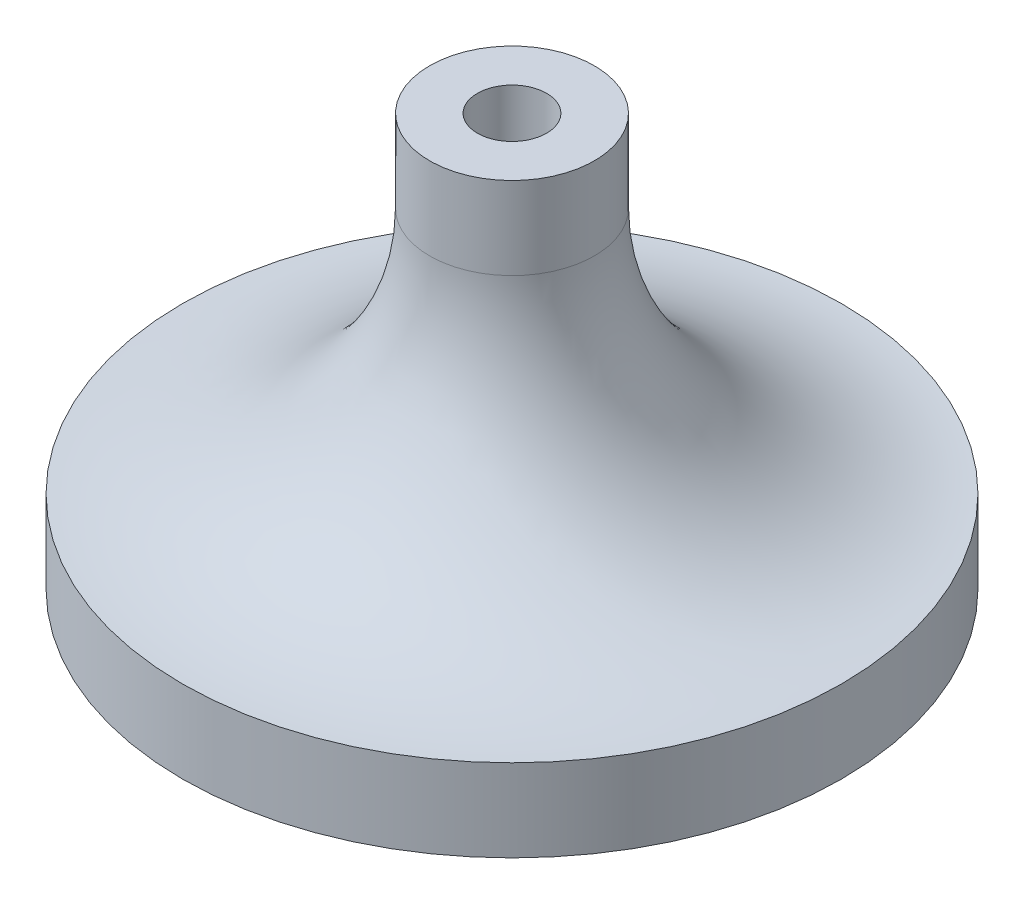
ISO-10303-21;
HEADER;
FILE_DESCRIPTION(('STEP AP214'),'2;1');
FILE_NAME('part.step','',(''),(''),'','','');
FILE_SCHEMA(('AUTOMOTIVE_DESIGN { 1 0 10303 214 1 1 1 1 }'));
ENDSEC;
DATA;
#1=APPLICATION_CONTEXT('core data for automotive mechanical design processes');
#2=APPLICATION_PROTOCOL_DEFINITION('international standard','automotive_design',2000,#1);
#3=PRODUCT_CONTEXT('',#1,'mechanical');
#4=PRODUCT('Part','Part','',(#3));
#5=PRODUCT_RELATED_PRODUCT_CATEGORY('part','',(#4));
#6=PRODUCT_DEFINITION_FORMATION('','',#4);
#7=PRODUCT_DEFINITION_CONTEXT('part definition',#1,'design');
#8=PRODUCT_DEFINITION('design','',#6,#7);
#9=PRODUCT_DEFINITION_SHAPE('','',#8);
#10=(LENGTH_UNIT() NAMED_UNIT(*) SI_UNIT(.MILLI.,.METRE.));
#11=(NAMED_UNIT(*) PLANE_ANGLE_UNIT() SI_UNIT($,.RADIAN.));
#12=(NAMED_UNIT(*) SI_UNIT($,.STERADIAN.) SOLID_ANGLE_UNIT());
#13=UNCERTAINTY_MEASURE_WITH_UNIT(LENGTH_MEASURE(1.E-05),#10,'distance_accuracy_value','');
#14=(GEOMETRIC_REPRESENTATION_CONTEXT(3) GLOBAL_UNCERTAINTY_ASSIGNED_CONTEXT((#13)) GLOBAL_UNIT_ASSIGNED_CONTEXT((#10,
#11,#12)) REPRESENTATION_CONTEXT('',''));
#15=CARTESIAN_POINT('',(0.,0.,0.));
#16=DIRECTION('',(0.,0.,1.));
#17=DIRECTION('',(1.,0.,0.));
#18=AXIS2_PLACEMENT_3D('',#15,#16,#17);
#19=CARTESIAN_POINT('',(-5.,25.,0.));
#20=DIRECTION('',(0.,1.,0.));
#21=DIRECTION('',(-1.,0.,0.));
#22=AXIS2_PLACEMENT_3D('',#19,#20,#21);
#23=PLANE('',#22);
#24=CARTESIAN_POINT('',(0.,25.,0.));
#25=DIRECTION('',(0.,1.,0.));
#26=DIRECTION('',(0.,0.,1.));
#27=AXIS2_PLACEMENT_3D('',#24,#25,#26);
#28=CIRCLE('',#27,2.1);
#29=CARTESIAN_POINT('',(0.,25.,2.1));
#30=VERTEX_POINT('',#29);
#31=EDGE_CURVE('E67',#30,#30,#28,.T.);
#32=ORIENTED_EDGE('',*,*,#31,.F.);
#33=EDGE_LOOP('',(#32));
#34=FACE_BOUND('',#33,.T.);
#35=CARTESIAN_POINT('',(0.,25.,0.));
#36=DIRECTION('',(0.,1.,0.));
#37=DIRECTION('',(-1.,0.,0.));
#38=AXIS2_PLACEMENT_3D('',#35,#36,#37);
#39=CIRCLE('',#38,5.);
#40=CARTESIAN_POINT('',(-5.,25.,0.));
#41=VERTEX_POINT('',#40);
#42=EDGE_CURVE('E11',#41,#41,#39,.T.);
#43=ORIENTED_EDGE('',*,*,#42,.T.);
#44=EDGE_LOOP('',(#43));
#45=FACE_BOUND('',#44,.T.);
#46=ADVANCED_FACE('F45',(#34,#45),#23,.T.);
#47=CARTESIAN_POINT('',(0.,25.,0.));
#48=DIRECTION('',(0.,1.,0.));
#49=DIRECTION('',(-1.,0.,0.));
#50=AXIS2_PLACEMENT_3D('',#47,#48,#49);
#51=CYLINDRICAL_SURFACE('',#50,5.);
#52=CARTESIAN_POINT('',(0.,20.,0.));
#53=DIRECTION('',(0.,1.,0.));
#54=DIRECTION('',(-1.,0.,0.));
#55=AXIS2_PLACEMENT_3D('',#52,#53,#54);
#56=CIRCLE('',#55,5.);
#57=CARTESIAN_POINT('',(-5.,20.,0.));
#58=VERTEX_POINT('',#57);
#59=EDGE_CURVE('E52',#58,#58,#56,.T.);
#60=ORIENTED_EDGE('',*,*,#59,.T.);
#61=EDGE_LOOP('',(#60));
#62=FACE_BOUND('',#61,.T.);
#63=ORIENTED_EDGE('',*,*,#42,.F.);
#64=EDGE_LOOP('',(#63));
#65=FACE_BOUND('',#64,.T.);
#66=ADVANCED_FACE('F83',(#62,#65),#51,.T.);
#67=CARTESIAN_POINT('',(0.,20.,0.));
#68=DIRECTION('',(0.,1.,0.));
#69=DIRECTION('',(-1.,0.,0.));
#70=AXIS2_PLACEMENT_3D('',#67,#68,#69);
#71=TOROIDAL_SURFACE('',#70,20.,15.);
#72=CARTESIAN_POINT('',(0.,5.,0.));
#73=DIRECTION('',(0.,1.,0.));
#74=DIRECTION('',(-1.,0.,0.));
#75=AXIS2_PLACEMENT_3D('',#72,#73,#74);
#76=CIRCLE('',#75,20.);
#77=CARTESIAN_POINT('',(-20.,5.,0.));
#78=VERTEX_POINT('',#77);
#79=EDGE_CURVE('E72',#78,#78,#76,.T.);
#80=ORIENTED_EDGE('',*,*,#79,.T.);
#81=EDGE_LOOP('',(#80));
#82=FACE_BOUND('',#81,.T.);
#83=ORIENTED_EDGE('',*,*,#59,.F.);
#84=EDGE_LOOP('',(#83));
#85=FACE_BOUND('',#84,.T.);
#86=ADVANCED_FACE('F86',(#82,#85),#71,.F.);
#87=CARTESIAN_POINT('',(0.,25.,0.));
#88=DIRECTION('',(0.,1.,0.));
#89=DIRECTION('',(-1.,0.,0.));
#90=AXIS2_PLACEMENT_3D('',#87,#88,#89);
#91=CYLINDRICAL_SURFACE('',#90,20.);
#92=CARTESIAN_POINT('',(0.,0.,0.));
#93=DIRECTION('',(0.,1.,0.));
#94=DIRECTION('',(-1.,0.,0.));
#95=AXIS2_PLACEMENT_3D('',#92,#93,#94);
#96=CIRCLE('',#95,20.);
#97=CARTESIAN_POINT('',(-20.,0.,0.));
#98=VERTEX_POINT('',#97);
#99=EDGE_CURVE('E66',#98,#98,#96,.T.);
#100=ORIENTED_EDGE('',*,*,#99,.T.);
#101=EDGE_LOOP('',(#100));
#102=FACE_BOUND('',#101,.T.);
#103=ORIENTED_EDGE('',*,*,#79,.F.);
#104=EDGE_LOOP('',(#103));
#105=FACE_BOUND('',#104,.T.);
#106=ADVANCED_FACE('F88',(#102,#105),#91,.T.);
#107=CARTESIAN_POINT('',(0.,0.,0.));
#108=DIRECTION('',(0.,-1.,0.));
#109=DIRECTION('',(1.,0.,0.));
#110=AXIS2_PLACEMENT_3D('',#107,#108,#109);
#111=PLANE('',#110);
#112=ORIENTED_EDGE('',*,*,#99,.F.);
#113=EDGE_LOOP('',(#112));
#114=FACE_BOUND('',#113,.T.);
#115=ADVANCED_FACE('F59',(#114),#111,.T.);
#116=CARTESIAN_POINT('',(0.,6.,0.));
#117=DIRECTION('',(0.,1.,0.));
#118=DIRECTION('',(0.,0.,1.));
#119=AXIS2_PLACEMENT_3D('',#116,#117,#118);
#120=CONICAL_SURFACE('',#119,2.1,1.02974425867665);
#121=CARTESIAN_POINT('',(0.,4.73819270004212,0.));
#122=VERTEX_POINT('',#121);
#123=VERTEX_LOOP('',#122);
#124=FACE_BOUND('',#123,.T.);
#125=CARTESIAN_POINT('',(0.,6.,0.));
#126=DIRECTION('',(0.,1.,0.));
#127=DIRECTION('',(0.,0.,1.));
#128=AXIS2_PLACEMENT_3D('',#125,#126,#127);
#129=CIRCLE('',#128,2.1);
#130=CARTESIAN_POINT('',(0.,6.,2.1));
#131=VERTEX_POINT('',#130);
#132=EDGE_CURVE('E63',#131,#131,#129,.T.);
#133=ORIENTED_EDGE('',*,*,#132,.T.);
#134=EDGE_LOOP('',(#133));
#135=FACE_BOUND('',#134,.T.);
#136=ADVANCED_FACE('F55',(#124,#135),#120,.F.);
#137=CARTESIAN_POINT('',(0.,25.,0.));
#138=DIRECTION('',(0.,1.,0.));
#139=DIRECTION('',(0.,0.,1.));
#140=AXIS2_PLACEMENT_3D('',#137,#138,#139);
#141=CYLINDRICAL_SURFACE('',#140,2.1);
#142=ORIENTED_EDGE('',*,*,#132,.F.);
#143=EDGE_LOOP('',(#142));
#144=FACE_BOUND('',#143,.T.);
#145=ORIENTED_EDGE('',*,*,#31,.T.);
#146=EDGE_LOOP('',(#145));
#147=FACE_BOUND('',#146,.T.);
#148=ADVANCED_FACE('F58',(#144,#147),#141,.F.);
#149=CLOSED_SHELL('',(#46,#66,#86,#106,#115,#136,#148));
#150=MANIFOLD_SOLID_BREP('B2',#149);
#151=ADVANCED_BREP_SHAPE_REPRESENTATION('',(#18,#150),#14);
#152=SHAPE_DEFINITION_REPRESENTATION(#9,#151);
ENDSEC;
END-ISO-10303-21;
